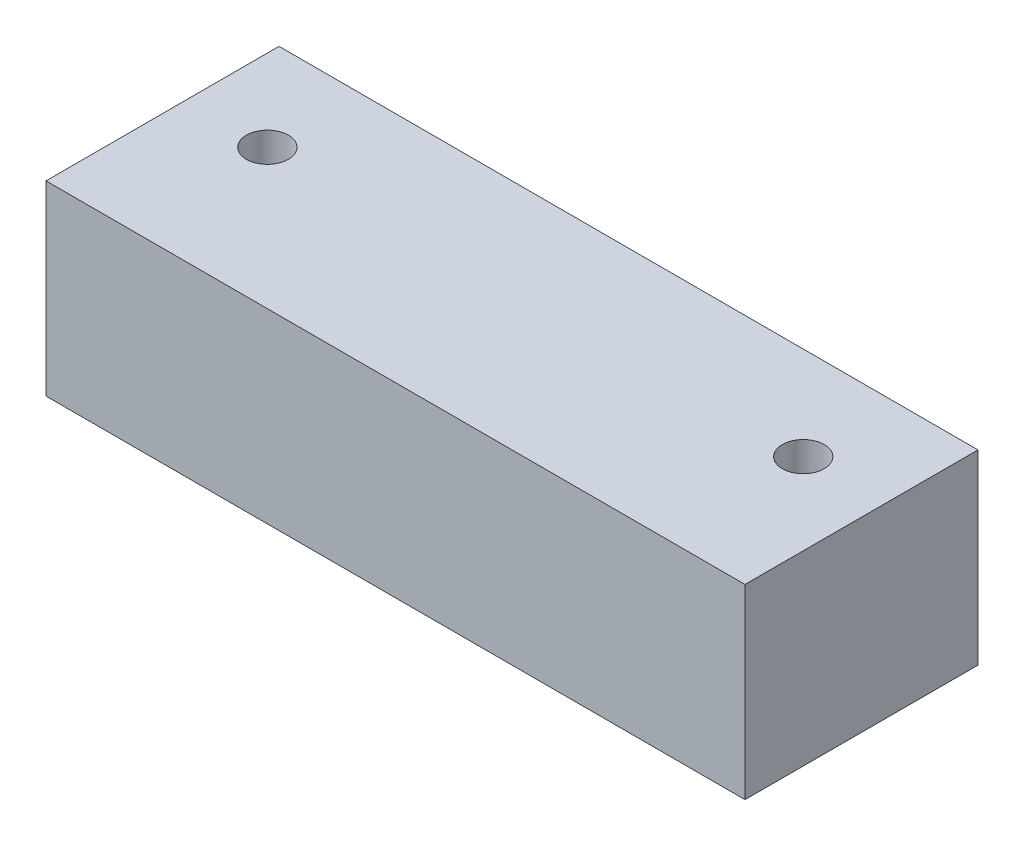
ISO-10303-21;
HEADER;
FILE_DESCRIPTION(('STEP AP214'),'2;1');
FILE_NAME('part.step','',(''),(''),'','','');
FILE_SCHEMA(('AUTOMOTIVE_DESIGN { 1 0 10303 214 1 1 1 1 }'));
ENDSEC;
DATA;
#1=APPLICATION_CONTEXT('core data for automotive mechanical design processes');
#2=APPLICATION_PROTOCOL_DEFINITION('international standard','automotive_design',2000,#1);
#3=PRODUCT_CONTEXT('',#1,'mechanical');
#4=PRODUCT('Part','Part','',(#3));
#5=PRODUCT_RELATED_PRODUCT_CATEGORY('part','',(#4));
#6=PRODUCT_DEFINITION_FORMATION('','',#4);
#7=PRODUCT_DEFINITION_CONTEXT('part definition',#1,'design');
#8=PRODUCT_DEFINITION('design','',#6,#7);
#9=PRODUCT_DEFINITION_SHAPE('','',#8);
#10=(LENGTH_UNIT() NAMED_UNIT(*) SI_UNIT(.MILLI.,.METRE.));
#11=(NAMED_UNIT(*) PLANE_ANGLE_UNIT() SI_UNIT($,.RADIAN.));
#12=(NAMED_UNIT(*) SI_UNIT($,.STERADIAN.) SOLID_ANGLE_UNIT());
#13=UNCERTAINTY_MEASURE_WITH_UNIT(LENGTH_MEASURE(1.E-05),#10,'distance_accuracy_value','');
#14=(GEOMETRIC_REPRESENTATION_CONTEXT(3) GLOBAL_UNCERTAINTY_ASSIGNED_CONTEXT((#13)) GLOBAL_UNIT_ASSIGNED_CONTEXT((#10,
#11,#12)) REPRESENTATION_CONTEXT('',''));
#15=CARTESIAN_POINT('',(0.,0.,0.));
#16=DIRECTION('',(0.,0.,1.));
#17=DIRECTION('',(1.,0.,0.));
#18=AXIS2_PLACEMENT_3D('',#15,#16,#17);
#19=CARTESIAN_POINT('',(-150.,-40.,50.));
#20=DIRECTION('',(1.,0.,0.));
#21=DIRECTION('',(0.,0.,-1.));
#22=AXIS2_PLACEMENT_3D('',#19,#20,#21);
#23=PLANE('',#22);
#24=DIRECTION('',(0.,-1.,0.));
#25=VECTOR('',#24,1.);
#26=CARTESIAN_POINT('',(-150.,-40.,-50.));
#27=LINE('',#26,#25);
#28=CARTESIAN_POINT('',(-150.,40.,-50.));
#29=VERTEX_POINT('',#28);
#30=CARTESIAN_POINT('',(-150.,-40.,-50.));
#31=VERTEX_POINT('',#30);
#32=EDGE_CURVE('E105',#29,#31,#27,.T.);
#33=ORIENTED_EDGE('',*,*,#32,.T.);
#34=DIRECTION('',(0.,0.,-1.));
#35=VECTOR('',#34,1.);
#36=CARTESIAN_POINT('',(-150.,-40.,50.));
#37=LINE('',#36,#35);
#38=CARTESIAN_POINT('',(-150.,-40.,50.));
#39=VERTEX_POINT('',#38);
#40=EDGE_CURVE('E11',#39,#31,#37,.T.);
#41=ORIENTED_EDGE('',*,*,#40,.F.);
#42=DIRECTION('',(0.,-1.,0.));
#43=VECTOR('',#42,1.);
#44=CARTESIAN_POINT('',(-150.,-40.,50.));
#45=LINE('',#44,#43);
#46=CARTESIAN_POINT('',(-150.,40.,50.));
#47=VERTEX_POINT('',#46);
#48=EDGE_CURVE('E87',#47,#39,#45,.T.);
#49=ORIENTED_EDGE('',*,*,#48,.F.);
#50=DIRECTION('',(0.,0.,-1.));
#51=VECTOR('',#50,1.);
#52=CARTESIAN_POINT('',(-150.,40.,50.));
#53=LINE('',#52,#51);
#54=EDGE_CURVE('E98',#47,#29,#53,.T.);
#55=ORIENTED_EDGE('',*,*,#54,.T.);
#56=EDGE_LOOP('',(#33,#41,#49,#55));
#57=FACE_BOUND('',#56,.T.);
#58=ADVANCED_FACE('F39',(#57),#23,.F.);
#59=CARTESIAN_POINT('',(-150.,-40.,50.));
#60=DIRECTION('',(0.,1.,0.));
#61=DIRECTION('',(0.,0.,1.));
#62=AXIS2_PLACEMENT_3D('',#59,#60,#61);
#63=PLANE('',#62);
#64=CARTESIAN_POINT('',(115.,-40.,-10.));
#65=DIRECTION('',(0.,1.,0.));
#66=DIRECTION('',(0.,0.,1.));
#67=AXIS2_PLACEMENT_3D('',#64,#65,#66);
#68=CIRCLE('',#67,9.);
#69=CARTESIAN_POINT('',(115.,-40.,-1.00000000000001));
#70=VERTEX_POINT('',#69);
#71=EDGE_CURVE('E122',#70,#70,#68,.T.);
#72=ORIENTED_EDGE('',*,*,#71,.T.);
#73=EDGE_LOOP('',(#72));
#74=FACE_BOUND('',#73,.T.);
#75=CARTESIAN_POINT('',(-115.,-40.,-10.));
#76=DIRECTION('',(0.,1.,0.));
#77=DIRECTION('',(0.,0.,1.));
#78=AXIS2_PLACEMENT_3D('',#75,#76,#77);
#79=CIRCLE('',#78,9.);
#80=CARTESIAN_POINT('',(-115.,-40.,-1.00000000000001));
#81=VERTEX_POINT('',#80);
#82=EDGE_CURVE('E104',#81,#81,#79,.T.);
#83=ORIENTED_EDGE('',*,*,#82,.T.);
#84=EDGE_LOOP('',(#83));
#85=FACE_BOUND('',#84,.T.);
#86=DIRECTION('',(1.,0.,0.));
#87=VECTOR('',#86,1.);
#88=CARTESIAN_POINT('',(-150.,-40.,-50.));
#89=LINE('',#88,#87);
#90=CARTESIAN_POINT('',(150.,-40.,-50.));
#91=VERTEX_POINT('',#90);
#92=EDGE_CURVE('E92',#31,#91,#89,.T.);
#93=ORIENTED_EDGE('',*,*,#92,.T.);
#94=DIRECTION('',(0.,0.,-1.));
#95=VECTOR('',#94,1.);
#96=CARTESIAN_POINT('',(150.,-40.,50.));
#97=LINE('',#96,#95);
#98=CARTESIAN_POINT('',(150.,-40.,50.));
#99=VERTEX_POINT('',#98);
#100=EDGE_CURVE('E50',#99,#91,#97,.T.);
#101=ORIENTED_EDGE('',*,*,#100,.F.);
#102=DIRECTION('',(1.,0.,0.));
#103=VECTOR('',#102,1.);
#104=CARTESIAN_POINT('',(-150.,-40.,50.));
#105=LINE('',#104,#103);
#106=EDGE_CURVE('E84',#39,#99,#105,.T.);
#107=ORIENTED_EDGE('',*,*,#106,.F.);
#108=ORIENTED_EDGE('',*,*,#40,.T.);
#109=EDGE_LOOP('',(#93,#101,#107,#108));
#110=FACE_BOUND('',#109,.T.);
#111=ADVANCED_FACE('F93',(#74,#85,#110),#63,.F.);
#112=CARTESIAN_POINT('',(150.,-40.,50.));
#113=DIRECTION('',(-1.,0.,0.));
#114=DIRECTION('',(0.,-1.,0.));
#115=AXIS2_PLACEMENT_3D('',#112,#113,#114);
#116=PLANE('',#115);
#117=DIRECTION('',(0.,1.,0.));
#118=VECTOR('',#117,1.);
#119=CARTESIAN_POINT('',(150.,-40.,-50.));
#120=LINE('',#119,#118);
#121=CARTESIAN_POINT('',(150.,40.,-50.));
#122=VERTEX_POINT('',#121);
#123=EDGE_CURVE('E75',#91,#122,#120,.T.);
#124=ORIENTED_EDGE('',*,*,#123,.T.);
#125=DIRECTION('',(0.,0.,-1.));
#126=VECTOR('',#125,1.);
#127=CARTESIAN_POINT('',(150.,40.,50.));
#128=LINE('',#127,#126);
#129=CARTESIAN_POINT('',(150.,40.,50.));
#130=VERTEX_POINT('',#129);
#131=EDGE_CURVE('E94',#130,#122,#128,.T.);
#132=ORIENTED_EDGE('',*,*,#131,.F.);
#133=DIRECTION('',(0.,1.,0.));
#134=VECTOR('',#133,1.);
#135=CARTESIAN_POINT('',(150.,-40.,50.));
#136=LINE('',#135,#134);
#137=EDGE_CURVE('E86',#99,#130,#136,.T.);
#138=ORIENTED_EDGE('',*,*,#137,.F.);
#139=ORIENTED_EDGE('',*,*,#100,.T.);
#140=EDGE_LOOP('',(#124,#132,#138,#139));
#141=FACE_BOUND('',#140,.T.);
#142=ADVANCED_FACE('F96',(#141),#116,.F.);
#143=CARTESIAN_POINT('',(-150.,40.,50.));
#144=DIRECTION('',(0.,-1.,0.));
#145=DIRECTION('',(1.,0.,0.));
#146=AXIS2_PLACEMENT_3D('',#143,#144,#145);
#147=PLANE('',#146);
#148=CARTESIAN_POINT('',(115.,40.,-10.));
#149=DIRECTION('',(0.,1.,0.));
#150=DIRECTION('',(0.,0.,1.));
#151=AXIS2_PLACEMENT_3D('',#148,#149,#150);
#152=CIRCLE('',#151,9.);
#153=CARTESIAN_POINT('',(115.,40.,-1.00000000000001));
#154=VERTEX_POINT('',#153);
#155=EDGE_CURVE('E124',#154,#154,#152,.T.);
#156=ORIENTED_EDGE('',*,*,#155,.F.);
#157=EDGE_LOOP('',(#156));
#158=FACE_BOUND('',#157,.T.);
#159=CARTESIAN_POINT('',(-115.,40.,-10.));
#160=DIRECTION('',(0.,1.,0.));
#161=DIRECTION('',(0.,0.,1.));
#162=AXIS2_PLACEMENT_3D('',#159,#160,#161);
#163=CIRCLE('',#162,9.);
#164=CARTESIAN_POINT('',(-115.,40.,-1.00000000000001));
#165=VERTEX_POINT('',#164);
#166=EDGE_CURVE('E118',#165,#165,#163,.T.);
#167=ORIENTED_EDGE('',*,*,#166,.F.);
#168=EDGE_LOOP('',(#167));
#169=FACE_BOUND('',#168,.T.);
#170=DIRECTION('',(-1.,0.,0.));
#171=VECTOR('',#170,1.);
#172=CARTESIAN_POINT('',(-150.,40.,-50.));
#173=LINE('',#172,#171);
#174=EDGE_CURVE('E78',#122,#29,#173,.T.);
#175=ORIENTED_EDGE('',*,*,#174,.T.);
#176=ORIENTED_EDGE('',*,*,#54,.F.);
#177=DIRECTION('',(-1.,0.,0.));
#178=VECTOR('',#177,1.);
#179=CARTESIAN_POINT('',(-150.,40.,50.));
#180=LINE('',#179,#178);
#181=EDGE_CURVE('E54',#130,#47,#180,.T.);
#182=ORIENTED_EDGE('',*,*,#181,.F.);
#183=ORIENTED_EDGE('',*,*,#131,.T.);
#184=EDGE_LOOP('',(#175,#176,#182,#183));
#185=FACE_BOUND('',#184,.T.);
#186=ADVANCED_FACE('F108',(#158,#169,#185),#147,.F.);
#187=CARTESIAN_POINT('',(0.,0.,50.));
#188=DIRECTION('',(0.,0.,-1.));
#189=DIRECTION('',(-1.,0.,0.));
#190=AXIS2_PLACEMENT_3D('',#187,#188,#189);
#191=PLANE('',#190);
#192=ORIENTED_EDGE('',*,*,#48,.T.);
#193=ORIENTED_EDGE('',*,*,#106,.T.);
#194=ORIENTED_EDGE('',*,*,#137,.T.);
#195=ORIENTED_EDGE('',*,*,#181,.T.);
#196=EDGE_LOOP('',(#192,#193,#194,#195));
#197=FACE_BOUND('',#196,.T.);
#198=ADVANCED_FACE('F88',(#197),#191,.F.);
#199=CARTESIAN_POINT('',(0.,0.,-50.));
#200=DIRECTION('',(0.,0.,-1.));
#201=DIRECTION('',(-1.,0.,0.));
#202=AXIS2_PLACEMENT_3D('',#199,#200,#201);
#203=PLANE('',#202);
#204=ORIENTED_EDGE('',*,*,#32,.F.);
#205=ORIENTED_EDGE('',*,*,#174,.F.);
#206=ORIENTED_EDGE('',*,*,#123,.F.);
#207=ORIENTED_EDGE('',*,*,#92,.F.);
#208=EDGE_LOOP('',(#204,#205,#206,#207));
#209=FACE_BOUND('',#208,.T.);
#210=ADVANCED_FACE('F114',(#209),#203,.T.);
#211=CARTESIAN_POINT('',(-115.,-40.,-10.));
#212=DIRECTION('',(0.,1.,0.));
#213=DIRECTION('',(0.,0.,1.));
#214=AXIS2_PLACEMENT_3D('',#211,#212,#213);
#215=CYLINDRICAL_SURFACE('',#214,9.);
#216=ORIENTED_EDGE('',*,*,#82,.F.);
#217=EDGE_LOOP('',(#216));
#218=FACE_BOUND('',#217,.T.);
#219=ORIENTED_EDGE('',*,*,#166,.T.);
#220=EDGE_LOOP('',(#219));
#221=FACE_BOUND('',#220,.T.);
#222=ADVANCED_FACE('F134',(#218,#221),#215,.F.);
#223=CARTESIAN_POINT('',(115.,-40.,-10.));
#224=DIRECTION('',(0.,1.,0.));
#225=DIRECTION('',(0.,0.,1.));
#226=AXIS2_PLACEMENT_3D('',#223,#224,#225);
#227=CYLINDRICAL_SURFACE('',#226,9.);
#228=ORIENTED_EDGE('',*,*,#71,.F.);
#229=EDGE_LOOP('',(#228));
#230=FACE_BOUND('',#229,.T.);
#231=ORIENTED_EDGE('',*,*,#155,.T.);
#232=EDGE_LOOP('',(#231));
#233=FACE_BOUND('',#232,.T.);
#234=ADVANCED_FACE('F128',(#230,#233),#227,.F.);
#235=CLOSED_SHELL('',(#58,#111,#142,#186,#198,#210,#222,#234));
#236=MANIFOLD_SOLID_BREP('B2',#235);
#237=ADVANCED_BREP_SHAPE_REPRESENTATION('',(#18,#236),#14);
#238=SHAPE_DEFINITION_REPRESENTATION(#9,#237);
ENDSEC;
END-ISO-10303-21;
